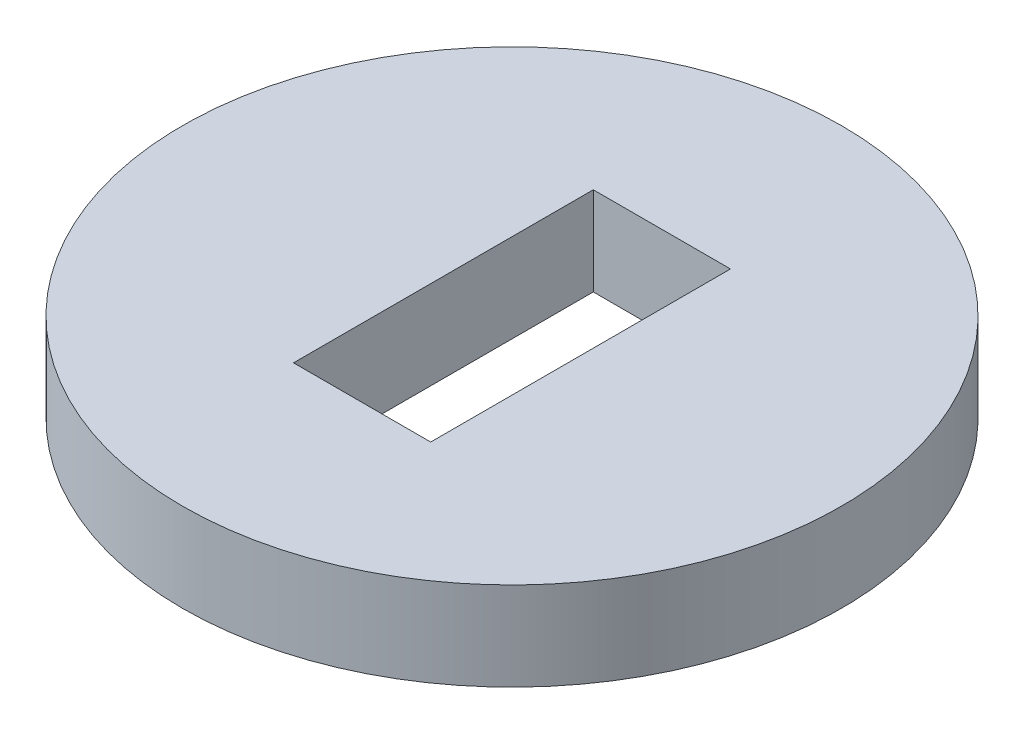
ISO-10303-21;
HEADER;
FILE_DESCRIPTION(('STEP AP214'),'2;1');
FILE_NAME('part.step','',(''),(''),'','','');
FILE_SCHEMA(('AUTOMOTIVE_DESIGN { 1 0 10303 214 1 1 1 1 }'));
ENDSEC;
DATA;
#1=APPLICATION_CONTEXT('core data for automotive mechanical design processes');
#2=APPLICATION_PROTOCOL_DEFINITION('international standard','automotive_design',2000,#1);
#3=PRODUCT_CONTEXT('',#1,'mechanical');
#4=PRODUCT('Part','Part','',(#3));
#5=PRODUCT_RELATED_PRODUCT_CATEGORY('part','',(#4));
#6=PRODUCT_DEFINITION_FORMATION('','',#4);
#7=PRODUCT_DEFINITION_CONTEXT('part definition',#1,'design');
#8=PRODUCT_DEFINITION('design','',#6,#7);
#9=PRODUCT_DEFINITION_SHAPE('','',#8);
#10=(LENGTH_UNIT() NAMED_UNIT(*) SI_UNIT(.MILLI.,.METRE.));
#11=(NAMED_UNIT(*) PLANE_ANGLE_UNIT() SI_UNIT($,.RADIAN.));
#12=(NAMED_UNIT(*) SI_UNIT($,.STERADIAN.) SOLID_ANGLE_UNIT());
#13=UNCERTAINTY_MEASURE_WITH_UNIT(LENGTH_MEASURE(1.E-05),#10,'distance_accuracy_value','');
#14=(GEOMETRIC_REPRESENTATION_CONTEXT(3) GLOBAL_UNCERTAINTY_ASSIGNED_CONTEXT((#13)) GLOBAL_UNIT_ASSIGNED_CONTEXT((#10,
#11,#12)) REPRESENTATION_CONTEXT('',''));
#15=CARTESIAN_POINT('',(0.,0.,0.));
#16=DIRECTION('',(0.,0.,1.));
#17=DIRECTION('',(1.,0.,0.));
#18=AXIS2_PLACEMENT_3D('',#15,#16,#17);
#19=CARTESIAN_POINT('',(0.,1.76999999999999,0.));
#20=DIRECTION('',(0.,1.,0.));
#21=DIRECTION('',(0.,0.,1.));
#22=AXIS2_PLACEMENT_3D('',#19,#20,#21);
#23=PLANE('',#22);
#24=CARTESIAN_POINT('',(0.,1.76999999999999,0.));
#25=DIRECTION('',(0.,1.,0.));
#26=DIRECTION('',(0.,0.,1.));
#27=AXIS2_PLACEMENT_3D('',#24,#25,#26);
#28=CIRCLE('',#27,6.59000000000001);
#29=CARTESIAN_POINT('',(0.,1.76999999999999,6.59000000000001));
#30=VERTEX_POINT('',#29);
#31=EDGE_CURVE('E11',#30,#30,#28,.T.);
#32=ORIENTED_EDGE('',*,*,#31,.T.);
#33=EDGE_LOOP('',(#32));
#34=FACE_BOUND('',#33,.T.);
#35=DIRECTION('',(1.,0.,0.));
#36=VECTOR('',#35,1.);
#37=CARTESIAN_POINT('',(-1.3716,1.76999999999999,2.9972));
#38=LINE('',#37,#36);
#39=CARTESIAN_POINT('',(-1.3716,1.76999999999999,2.9972));
#40=VERTEX_POINT('',#39);
#41=CARTESIAN_POINT('',(1.37160000000001,1.77000000000001,2.9972));
#42=VERTEX_POINT('',#41);
#43=EDGE_CURVE('E87',#40,#42,#38,.T.);
#44=ORIENTED_EDGE('',*,*,#43,.F.);
#45=DIRECTION('',(0.,0.,1.));
#46=VECTOR('',#45,1.);
#47=CARTESIAN_POINT('',(-1.3716,1.77000000000001,-2.9972));
#48=LINE('',#47,#46);
#49=CARTESIAN_POINT('',(-1.3716,1.77000000000001,-2.9972));
#50=VERTEX_POINT('',#49);
#51=EDGE_CURVE('E78',#50,#40,#48,.T.);
#52=ORIENTED_EDGE('',*,*,#51,.F.);
#53=DIRECTION('',(-1.,0.,0.));
#54=VECTOR('',#53,1.);
#55=CARTESIAN_POINT('',(-1.3716,1.77000000000001,-2.9972));
#56=LINE('',#55,#54);
#57=CARTESIAN_POINT('',(1.37160000000001,1.77000000000001,-2.9972));
#58=VERTEX_POINT('',#57);
#59=EDGE_CURVE('E104',#58,#50,#56,.T.);
#60=ORIENTED_EDGE('',*,*,#59,.F.);
#61=DIRECTION('',(0.,0.,-1.));
#62=VECTOR('',#61,1.);
#63=CARTESIAN_POINT('',(1.37160000000001,1.77000000000001,-2.9972));
#64=LINE('',#63,#62);
#65=EDGE_CURVE('E99',#42,#58,#64,.T.);
#66=ORIENTED_EDGE('',*,*,#65,.F.);
#67=EDGE_LOOP('',(#44,#52,#60,#66));
#68=FACE_BOUND('',#67,.T.);
#69=ADVANCED_FACE('F36',(#34,#68),#23,.T.);
#70=CARTESIAN_POINT('',(0.,0.,0.));
#71=DIRECTION('',(0.,1.,0.));
#72=DIRECTION('',(0.,0.,1.));
#73=AXIS2_PLACEMENT_3D('',#70,#71,#72);
#74=PLANE('',#73);
#75=CARTESIAN_POINT('',(0.,0.,0.));
#76=DIRECTION('',(0.,1.,0.));
#77=DIRECTION('',(0.,0.,1.));
#78=AXIS2_PLACEMENT_3D('',#75,#76,#77);
#79=CIRCLE('',#78,6.59000000000001);
#80=CARTESIAN_POINT('',(0.,0.,6.59000000000001));
#81=VERTEX_POINT('',#80);
#82=EDGE_CURVE('E40',#81,#81,#79,.T.);
#83=ORIENTED_EDGE('',*,*,#82,.F.);
#84=EDGE_LOOP('',(#83));
#85=FACE_BOUND('',#84,.T.);
#86=DIRECTION('',(0.,0.,1.));
#87=VECTOR('',#86,1.);
#88=CARTESIAN_POINT('',(-1.37159999999999,0.,-2.9972));
#89=LINE('',#88,#87);
#90=CARTESIAN_POINT('',(-1.37159999999999,0.,-2.9972));
#91=VERTEX_POINT('',#90);
#92=CARTESIAN_POINT('',(-1.3716,0.,2.9972));
#93=VERTEX_POINT('',#92);
#94=EDGE_CURVE('E60',#91,#93,#89,.T.);
#95=ORIENTED_EDGE('',*,*,#94,.T.);
#96=DIRECTION('',(1.,0.,0.));
#97=VECTOR('',#96,1.);
#98=CARTESIAN_POINT('',(-1.3716,0.,2.9972));
#99=LINE('',#98,#97);
#100=CARTESIAN_POINT('',(1.3716,0.,2.9972));
#101=VERTEX_POINT('',#100);
#102=EDGE_CURVE('E94',#93,#101,#99,.T.);
#103=ORIENTED_EDGE('',*,*,#102,.T.);
#104=DIRECTION('',(0.,0.,-1.));
#105=VECTOR('',#104,1.);
#106=CARTESIAN_POINT('',(1.37160000000001,0.,-2.9972));
#107=LINE('',#106,#105);
#108=CARTESIAN_POINT('',(1.37160000000001,0.,-2.9972));
#109=VERTEX_POINT('',#108);
#110=EDGE_CURVE('E113',#101,#109,#107,.T.);
#111=ORIENTED_EDGE('',*,*,#110,.T.);
#112=DIRECTION('',(-1.,0.,0.));
#113=VECTOR('',#112,1.);
#114=CARTESIAN_POINT('',(-1.37159999999999,0.,-2.9972));
#115=LINE('',#114,#113);
#116=EDGE_CURVE('E88',#109,#91,#115,.T.);
#117=ORIENTED_EDGE('',*,*,#116,.T.);
#118=EDGE_LOOP('',(#95,#103,#111,#117));
#119=FACE_BOUND('',#118,.T.);
#120=ADVANCED_FACE('F130',(#85,#119),#74,.F.);
#121=CARTESIAN_POINT('',(0.,1.76999999999999,0.));
#122=DIRECTION('',(0.,-1.,0.));
#123=DIRECTION('',(0.,0.,-1.));
#124=AXIS2_PLACEMENT_3D('',#121,#122,#123);
#125=CYLINDRICAL_SURFACE('',#124,6.59000000000001);
#126=ORIENTED_EDGE('',*,*,#31,.F.);
#127=EDGE_LOOP('',(#126));
#128=FACE_BOUND('',#127,.T.);
#129=ORIENTED_EDGE('',*,*,#82,.T.);
#130=EDGE_LOOP('',(#129));
#131=FACE_BOUND('',#130,.T.);
#132=ADVANCED_FACE('F38',(#128,#131),#125,.T.);
#133=CARTESIAN_POINT('',(-1.3716,1.77000000000001,-2.9972));
#134=DIRECTION('',(1.,0.,0.));
#135=DIRECTION('',(0.,0.,-1.));
#136=AXIS2_PLACEMENT_3D('',#133,#134,#135);
#137=PLANE('',#136);
#138=ORIENTED_EDGE('',*,*,#94,.F.);
#139=DIRECTION('',(0.,-1.,0.));
#140=VECTOR('',#139,1.);
#141=CARTESIAN_POINT('',(-1.3716,1.77000000000001,-2.9972));
#142=LINE('',#141,#140);
#143=EDGE_CURVE('E82',#50,#91,#142,.T.);
#144=ORIENTED_EDGE('',*,*,#143,.F.);
#145=ORIENTED_EDGE('',*,*,#51,.T.);
#146=DIRECTION('',(0.,-1.,0.));
#147=VECTOR('',#146,1.);
#148=CARTESIAN_POINT('',(-1.3716,1.76999999999999,2.9972));
#149=LINE('',#148,#147);
#150=EDGE_CURVE('E81',#40,#93,#149,.T.);
#151=ORIENTED_EDGE('',*,*,#150,.T.);
#152=EDGE_LOOP('',(#138,#144,#145,#151));
#153=FACE_BOUND('',#152,.T.);
#154=ADVANCED_FACE('F80',(#153),#137,.T.);
#155=CARTESIAN_POINT('',(-1.3716,1.76999999999999,2.9972));
#156=DIRECTION('',(0.,0.,-1.));
#157=DIRECTION('',(-1.,0.,0.));
#158=AXIS2_PLACEMENT_3D('',#155,#156,#157);
#159=PLANE('',#158);
#160=ORIENTED_EDGE('',*,*,#102,.F.);
#161=ORIENTED_EDGE('',*,*,#150,.F.);
#162=ORIENTED_EDGE('',*,*,#43,.T.);
#163=DIRECTION('',(0.,-1.,0.));
#164=VECTOR('',#163,1.);
#165=CARTESIAN_POINT('',(1.37160000000001,1.77000000000001,2.9972));
#166=LINE('',#165,#164);
#167=EDGE_CURVE('E96',#42,#101,#166,.T.);
#168=ORIENTED_EDGE('',*,*,#167,.T.);
#169=EDGE_LOOP('',(#160,#161,#162,#168));
#170=FACE_BOUND('',#169,.T.);
#171=ADVANCED_FACE('F91',(#170),#159,.T.);
#172=CARTESIAN_POINT('',(1.37160000000001,1.77000000000001,-2.9972));
#173=DIRECTION('',(-1.,0.,0.));
#174=DIRECTION('',(0.,0.,1.));
#175=AXIS2_PLACEMENT_3D('',#172,#173,#174);
#176=PLANE('',#175);
#177=ORIENTED_EDGE('',*,*,#110,.F.);
#178=ORIENTED_EDGE('',*,*,#167,.F.);
#179=ORIENTED_EDGE('',*,*,#65,.T.);
#180=DIRECTION('',(0.,-1.,0.));
#181=VECTOR('',#180,1.);
#182=CARTESIAN_POINT('',(1.37160000000001,1.77000000000001,-2.9972));
#183=LINE('',#182,#181);
#184=EDGE_CURVE('E52',#58,#109,#183,.T.);
#185=ORIENTED_EDGE('',*,*,#184,.T.);
#186=EDGE_LOOP('',(#177,#178,#179,#185));
#187=FACE_BOUND('',#186,.T.);
#188=ADVANCED_FACE('F128',(#187),#176,.T.);
#189=CARTESIAN_POINT('',(-1.3716,1.77000000000001,-2.9972));
#190=DIRECTION('',(0.,0.,1.));
#191=DIRECTION('',(1.,0.,0.));
#192=AXIS2_PLACEMENT_3D('',#189,#190,#191);
#193=PLANE('',#192);
#194=ORIENTED_EDGE('',*,*,#116,.F.);
#195=ORIENTED_EDGE('',*,*,#184,.F.);
#196=ORIENTED_EDGE('',*,*,#59,.T.);
#197=ORIENTED_EDGE('',*,*,#143,.T.);
#198=EDGE_LOOP('',(#194,#195,#196,#197));
#199=FACE_BOUND('',#198,.T.);
#200=ADVANCED_FACE('F131',(#199),#193,.T.);
#201=CLOSED_SHELL('',(#69,#120,#132,#154,#171,#188,#200));
#202=MANIFOLD_SOLID_BREP('B2',#201);
#203=ADVANCED_BREP_SHAPE_REPRESENTATION('',(#18,#202),#14);
#204=SHAPE_DEFINITION_REPRESENTATION(#9,#203);
ENDSEC;
END-ISO-10303-21;
